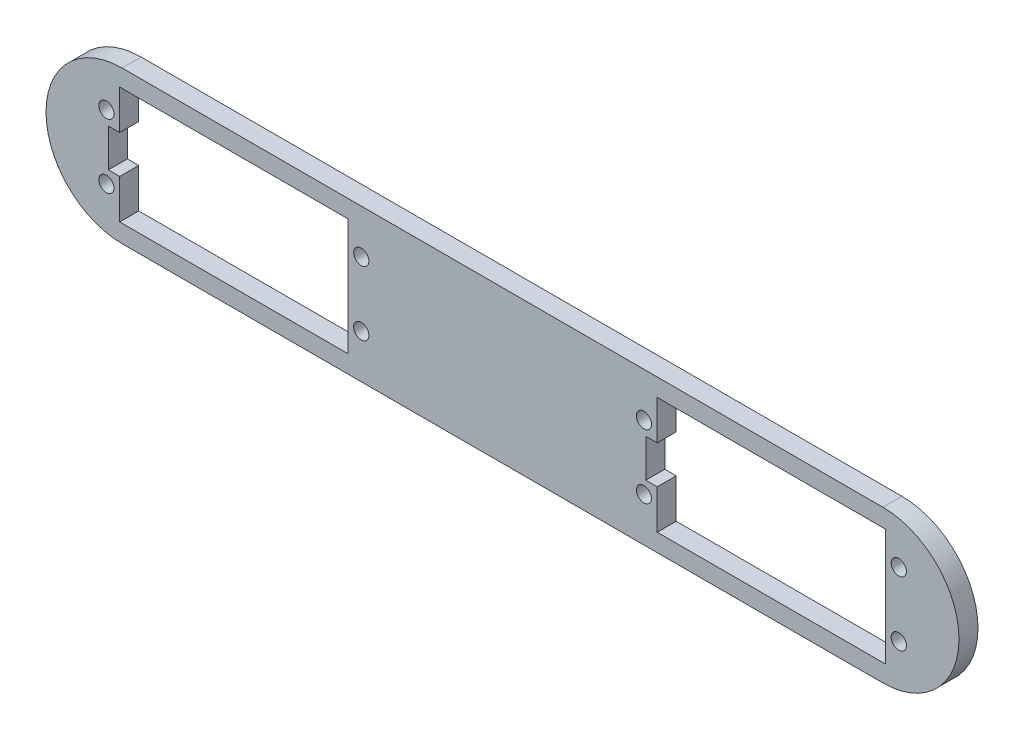
ISO-10303-21;
HEADER;
FILE_DESCRIPTION(('STEP AP214'),'2;1');
FILE_NAME('part.step','',(''),(''),'','','');
FILE_SCHEMA(('AUTOMOTIVE_DESIGN { 1 0 10303 214 1 1 1 1 }'));
ENDSEC;
DATA;
#1=APPLICATION_CONTEXT('core data for automotive mechanical design processes');
#2=APPLICATION_PROTOCOL_DEFINITION('international standard','automotive_design',2000,#1);
#3=PRODUCT_CONTEXT('',#1,'mechanical');
#4=PRODUCT('Part','Part','',(#3));
#5=PRODUCT_RELATED_PRODUCT_CATEGORY('part','',(#4));
#6=PRODUCT_DEFINITION_FORMATION('','',#4);
#7=PRODUCT_DEFINITION_CONTEXT('part definition',#1,'design');
#8=PRODUCT_DEFINITION('design','',#6,#7);
#9=PRODUCT_DEFINITION_SHAPE('','',#8);
#10=(LENGTH_UNIT() NAMED_UNIT(*) SI_UNIT(.MILLI.,.METRE.));
#11=(NAMED_UNIT(*) PLANE_ANGLE_UNIT() SI_UNIT($,.RADIAN.));
#12=(NAMED_UNIT(*) SI_UNIT($,.STERADIAN.) SOLID_ANGLE_UNIT());
#13=UNCERTAINTY_MEASURE_WITH_UNIT(LENGTH_MEASURE(1.E-05),#10,'distance_accuracy_value','');
#14=(GEOMETRIC_REPRESENTATION_CONTEXT(3) GLOBAL_UNCERTAINTY_ASSIGNED_CONTEXT((#13)) GLOBAL_UNIT_ASSIGNED_CONTEXT((#10,
#11,#12)) REPRESENTATION_CONTEXT('',''));
#15=CARTESIAN_POINT('',(0.,0.,0.));
#16=DIRECTION('',(0.,0.,1.));
#17=DIRECTION('',(1.,0.,0.));
#18=AXIS2_PLACEMENT_3D('',#15,#16,#17);
#19=CARTESIAN_POINT('',(0.,0.,5.));
#20=DIRECTION('',(0.,0.,1.));
#21=DIRECTION('',(1.,0.,0.));
#22=AXIS2_PLACEMENT_3D('',#19,#20,#21);
#23=PLANE('',#22);
#24=CARTESIAN_POINT('',(62.8784347206922,8.45000000000092,5.));
#25=DIRECTION('',(0.,0.,1.));
#26=DIRECTION('',(1.,0.,0.));
#27=AXIS2_PLACEMENT_3D('',#24,#25,#26);
#28=CIRCLE('',#27,2.);
#29=CARTESIAN_POINT('',(64.8784347206922,8.45000000000092,5.));
#30=VERTEX_POINT('',#29);
#31=EDGE_CURVE('E618',#30,#30,#28,.T.);
#32=ORIENTED_EDGE('',*,*,#31,.F.);
#33=EDGE_LOOP('',(#32));
#34=FACE_BOUND('',#33,.T.);
#35=CARTESIAN_POINT('',(62.8784347206922,-8.44999999999908,5.));
#36=DIRECTION('',(0.,0.,1.));
#37=DIRECTION('',(1.,0.,0.));
#38=AXIS2_PLACEMENT_3D('',#35,#36,#37);
#39=CIRCLE('',#38,2.);
#40=CARTESIAN_POINT('',(64.8784347206922,-8.44999999999908,5.));
#41=VERTEX_POINT('',#40);
#42=EDGE_CURVE('E628',#41,#41,#39,.T.);
#43=ORIENTED_EDGE('',*,*,#42,.F.);
#44=EDGE_LOOP('',(#43));
#45=FACE_BOUND('',#44,.T.);
#46=CARTESIAN_POINT('',(-4.12156527930781,-8.44999999999911,5.));
#47=DIRECTION('',(0.,0.,1.));
#48=DIRECTION('',(1.,0.,0.));
#49=AXIS2_PLACEMENT_3D('',#46,#47,#48);
#50=CIRCLE('',#49,2.00000000000001);
#51=CARTESIAN_POINT('',(-2.1215652793078,-8.44999999999911,5.));
#52=VERTEX_POINT('',#51);
#53=EDGE_CURVE('E634',#52,#52,#50,.T.);
#54=ORIENTED_EDGE('',*,*,#53,.F.);
#55=EDGE_LOOP('',(#54));
#56=FACE_BOUND('',#55,.T.);
#57=CARTESIAN_POINT('',(-4.12156527930781,8.45000000000091,5.));
#58=DIRECTION('',(0.,0.,1.));
#59=DIRECTION('',(1.,0.,0.));
#60=AXIS2_PLACEMENT_3D('',#57,#58,#59);
#61=CIRCLE('',#60,2.00000000000001);
#62=CARTESIAN_POINT('',(-2.1215652793078,8.45000000000091,5.));
#63=VERTEX_POINT('',#62);
#64=EDGE_CURVE('E640',#63,#63,#61,.T.);
#65=ORIENTED_EDGE('',*,*,#64,.F.);
#66=EDGE_LOOP('',(#65));
#67=FACE_BOUND('',#66,.T.);
#68=CARTESIAN_POINT('',(204.172709247136,-8.45000000000016,5.));
#69=DIRECTION('',(0.,0.,1.));
#70=DIRECTION('',(1.,0.,0.));
#71=AXIS2_PLACEMENT_3D('',#68,#69,#70);
#72=CIRCLE('',#71,2.);
#73=CARTESIAN_POINT('',(206.172709247136,-8.45000000000016,5.));
#74=VERTEX_POINT('',#73);
#75=EDGE_CURVE('E646',#74,#74,#72,.T.);
#76=ORIENTED_EDGE('',*,*,#75,.F.);
#77=EDGE_LOOP('',(#76));
#78=FACE_BOUND('',#77,.T.);
#79=CARTESIAN_POINT('',(204.172709247136,8.44999999999985,5.));
#80=DIRECTION('',(0.,0.,1.));
#81=DIRECTION('',(1.,0.,0.));
#82=AXIS2_PLACEMENT_3D('',#79,#80,#81);
#83=CIRCLE('',#82,1.99999999999999);
#84=CARTESIAN_POINT('',(206.172709247136,8.44999999999985,5.));
#85=VERTEX_POINT('',#84);
#86=EDGE_CURVE('E652',#85,#85,#83,.T.);
#87=ORIENTED_EDGE('',*,*,#86,.F.);
#88=EDGE_LOOP('',(#87));
#89=FACE_BOUND('',#88,.T.);
#90=CARTESIAN_POINT('',(137.172709247136,-8.45000000000024,5.));
#91=DIRECTION('',(0.,0.,1.));
#92=DIRECTION('',(1.,0.,0.));
#93=AXIS2_PLACEMENT_3D('',#90,#91,#92);
#94=CIRCLE('',#93,1.97954260621658);
#95=CARTESIAN_POINT('',(139.152251853353,-8.45000000000024,5.));
#96=VERTEX_POINT('',#95);
#97=EDGE_CURVE('E658',#96,#96,#94,.T.);
#98=ORIENTED_EDGE('',*,*,#97,.F.);
#99=EDGE_LOOP('',(#98));
#100=FACE_BOUND('',#99,.T.);
#101=CARTESIAN_POINT('',(137.172709247136,8.44999999999977,5.));
#102=DIRECTION('',(0.,0.,1.));
#103=DIRECTION('',(1.,0.,0.));
#104=AXIS2_PLACEMENT_3D('',#101,#102,#103);
#105=CIRCLE('',#104,2.);
#106=CARTESIAN_POINT('',(139.172709247136,8.44999999999977,5.));
#107=VERTEX_POINT('',#106);
#108=EDGE_CURVE('E206',#107,#107,#105,.T.);
#109=ORIENTED_EDGE('',*,*,#108,.F.);
#110=EDGE_LOOP('',(#109));
#111=FACE_BOUND('',#110,.T.);
#112=CARTESIAN_POINT('',(0.,0.,5.));
#113=DIRECTION('',(0.,0.,1.));
#114=DIRECTION('',(1.,0.,0.));
#115=AXIS2_PLACEMENT_3D('',#112,#113,#114);
#116=CIRCLE('',#115,20.);
#117=CARTESIAN_POINT('',(0.,20.,5.));
#118=VERTEX_POINT('',#117);
#119=CARTESIAN_POINT('',(0.,-20.,5.));
#120=VERTEX_POINT('',#119);
#121=EDGE_CURVE('E295',#118,#120,#116,.T.);
#122=ORIENTED_EDGE('',*,*,#121,.T.);
#123=DIRECTION('',(1.,0.,0.));
#124=VECTOR('',#123,1.);
#125=CARTESIAN_POINT('',(0.,-20.,5.));
#126=LINE('',#125,#124);
#127=CARTESIAN_POINT('',(200.,-20.,5.));
#128=VERTEX_POINT('',#127);
#129=EDGE_CURVE('E298',#120,#128,#126,.T.);
#130=ORIENTED_EDGE('',*,*,#129,.T.);
#131=CARTESIAN_POINT('',(200.,0.,5.));
#132=DIRECTION('',(0.,0.,1.));
#133=DIRECTION('',(1.,0.,0.));
#134=AXIS2_PLACEMENT_3D('',#131,#132,#133);
#135=CIRCLE('',#134,20.);
#136=CARTESIAN_POINT('',(200.,20.,5.));
#137=VERTEX_POINT('',#136);
#138=EDGE_CURVE('E301',#128,#137,#135,.T.);
#139=ORIENTED_EDGE('',*,*,#138,.T.);
#140=DIRECTION('',(-1.,0.,0.));
#141=VECTOR('',#140,1.);
#142=CARTESIAN_POINT('',(0.,20.,5.));
#143=LINE('',#142,#141);
#144=EDGE_CURVE('E303',#137,#118,#143,.T.);
#145=ORIENTED_EDGE('',*,*,#144,.T.);
#146=EDGE_LOOP('',(#122,#130,#139,#145));
#147=FACE_BOUND('',#146,.T.);
#148=DIRECTION('',(-1.,0.,0.));
#149=VECTOR('',#148,1.);
#150=CARTESIAN_POINT('',(-0.621565279305992,15.35,5.));
#151=LINE('',#150,#149);
#152=CARTESIAN_POINT('',(59.378434720694,15.35,5.));
#153=VERTEX_POINT('',#152);
#154=CARTESIAN_POINT('',(-0.621565279305992,15.35,5.));
#155=VERTEX_POINT('',#154);
#156=EDGE_CURVE('E238',#153,#155,#151,.T.);
#157=ORIENTED_EDGE('',*,*,#156,.F.);
#158=DIRECTION('',(0.,1.,0.));
#159=VECTOR('',#158,1.);
#160=CARTESIAN_POINT('',(59.378434720694,15.35,5.));
#161=LINE('',#160,#159);
#162=CARTESIAN_POINT('',(59.378434720694,-15.35,5.));
#163=VERTEX_POINT('',#162);
#164=EDGE_CURVE('E236',#163,#153,#161,.T.);
#165=ORIENTED_EDGE('',*,*,#164,.F.);
#166=DIRECTION('',(1.,0.,0.));
#167=VECTOR('',#166,1.);
#168=CARTESIAN_POINT('',(-0.621565279305986,-15.35,5.));
#169=LINE('',#168,#167);
#170=CARTESIAN_POINT('',(-0.621565279305986,-15.35,5.));
#171=VERTEX_POINT('',#170);
#172=EDGE_CURVE('E252',#171,#163,#169,.T.);
#173=ORIENTED_EDGE('',*,*,#172,.F.);
#174=DIRECTION('',(0.,-1.,0.));
#175=VECTOR('',#174,1.);
#176=CARTESIAN_POINT('',(-0.621565279305989,-5.,5.));
#177=LINE('',#176,#175);
#178=CARTESIAN_POINT('',(-0.621565279305989,-5.,5.));
#179=VERTEX_POINT('',#178);
#180=EDGE_CURVE('E249',#179,#171,#177,.T.);
#181=ORIENTED_EDGE('',*,*,#180,.F.);
#182=DIRECTION('',(1.,0.,0.));
#183=VECTOR('',#182,1.);
#184=CARTESIAN_POINT('',(-0.621565279305989,-5.,5.));
#185=LINE('',#184,#183);
#186=CARTESIAN_POINT('',(-3.62156527930599,-5.,5.));
#187=VERTEX_POINT('',#186);
#188=EDGE_CURVE('E247',#187,#179,#185,.T.);
#189=ORIENTED_EDGE('',*,*,#188,.F.);
#190=DIRECTION('',(0.,-1.,0.));
#191=VECTOR('',#190,1.);
#192=CARTESIAN_POINT('',(-3.62156527930599,5.,5.));
#193=LINE('',#192,#191);
#194=CARTESIAN_POINT('',(-3.62156527930599,5.,5.));
#195=VERTEX_POINT('',#194);
#196=EDGE_CURVE('E245',#195,#187,#193,.T.);
#197=ORIENTED_EDGE('',*,*,#196,.F.);
#198=DIRECTION('',(-1.,0.,0.));
#199=VECTOR('',#198,1.);
#200=CARTESIAN_POINT('',(-0.621565279305989,5.,5.));
#201=LINE('',#200,#199);
#202=CARTESIAN_POINT('',(-0.621565279305989,5.,5.));
#203=VERTEX_POINT('',#202);
#204=EDGE_CURVE('E243',#203,#195,#201,.T.);
#205=ORIENTED_EDGE('',*,*,#204,.F.);
#206=DIRECTION('',(0.,-1.,0.));
#207=VECTOR('',#206,1.);
#208=CARTESIAN_POINT('',(-0.621565279305992,15.35,5.));
#209=LINE('',#208,#207);
#210=EDGE_CURVE('E241',#155,#203,#209,.T.);
#211=ORIENTED_EDGE('',*,*,#210,.F.);
#212=EDGE_LOOP('',(#157,#165,#173,#181,#189,#197,#205,#211));
#213=FACE_BOUND('',#212,.T.);
#214=DIRECTION('',(-1.,0.,0.));
#215=VECTOR('',#214,1.);
#216=CARTESIAN_POINT('',(140.672709247137,15.35,5.));
#217=LINE('',#216,#215);
#218=CARTESIAN_POINT('',(200.672709247137,15.35,5.));
#219=VERTEX_POINT('',#218);
#220=CARTESIAN_POINT('',(140.672709247137,15.35,5.));
#221=VERTEX_POINT('',#220);
#222=EDGE_CURVE('E177',#219,#221,#217,.T.);
#223=ORIENTED_EDGE('',*,*,#222,.F.);
#224=DIRECTION('',(0.,1.,0.));
#225=VECTOR('',#224,1.);
#226=CARTESIAN_POINT('',(200.672709247137,15.35,5.));
#227=LINE('',#226,#225);
#228=CARTESIAN_POINT('',(200.672709247137,-15.35,5.));
#229=VERTEX_POINT('',#228);
#230=EDGE_CURVE('E169',#229,#219,#227,.T.);
#231=ORIENTED_EDGE('',*,*,#230,.F.);
#232=DIRECTION('',(1.,0.,0.));
#233=VECTOR('',#232,1.);
#234=CARTESIAN_POINT('',(140.672709247137,-15.35,5.));
#235=LINE('',#234,#233);
#236=CARTESIAN_POINT('',(140.672709247137,-15.35,5.));
#237=VERTEX_POINT('',#236);
#238=EDGE_CURVE('E203',#237,#229,#235,.T.);
#239=ORIENTED_EDGE('',*,*,#238,.F.);
#240=DIRECTION('',(0.,-1.,0.));
#241=VECTOR('',#240,1.);
#242=CARTESIAN_POINT('',(140.672709247137,-5.,5.));
#243=LINE('',#242,#241);
#244=CARTESIAN_POINT('',(140.672709247137,-5.,5.));
#245=VERTEX_POINT('',#244);
#246=EDGE_CURVE('E201',#245,#237,#243,.T.);
#247=ORIENTED_EDGE('',*,*,#246,.F.);
#248=DIRECTION('',(1.,0.,0.));
#249=VECTOR('',#248,1.);
#250=CARTESIAN_POINT('',(140.672709247137,-5.,5.));
#251=LINE('',#250,#249);
#252=CARTESIAN_POINT('',(137.672709247137,-5.,5.));
#253=VERTEX_POINT('',#252);
#254=EDGE_CURVE('E199',#253,#245,#251,.T.);
#255=ORIENTED_EDGE('',*,*,#254,.F.);
#256=DIRECTION('',(0.,-1.,0.));
#257=VECTOR('',#256,1.);
#258=CARTESIAN_POINT('',(137.672709247137,5.,5.));
#259=LINE('',#258,#257);
#260=CARTESIAN_POINT('',(137.672709247137,5.,5.));
#261=VERTEX_POINT('',#260);
#262=EDGE_CURVE('E197',#261,#253,#259,.T.);
#263=ORIENTED_EDGE('',*,*,#262,.F.);
#264=DIRECTION('',(-1.,0.,0.));
#265=VECTOR('',#264,1.);
#266=CARTESIAN_POINT('',(140.672709247137,5.,5.));
#267=LINE('',#266,#265);
#268=CARTESIAN_POINT('',(140.672709247137,5.,5.));
#269=VERTEX_POINT('',#268);
#270=EDGE_CURVE('E192',#269,#261,#267,.T.);
#271=ORIENTED_EDGE('',*,*,#270,.F.);
#272=DIRECTION('',(0.,-1.,0.));
#273=VECTOR('',#272,1.);
#274=CARTESIAN_POINT('',(140.672709247137,15.35,5.));
#275=LINE('',#274,#273);
#276=EDGE_CURVE('E190',#221,#269,#275,.T.);
#277=ORIENTED_EDGE('',*,*,#276,.F.);
#278=EDGE_LOOP('',(#223,#231,#239,#247,#255,#263,#271,#277));
#279=FACE_BOUND('',#278,.T.);
#280=ADVANCED_FACE('F32',(#34,#45,#56,#67,#78,#89,#100,#111,#147,#213,#279),#23,.T.);
#281=CARTESIAN_POINT('',(0.,0.,0.));
#282=DIRECTION('',(0.,0.,1.));
#283=DIRECTION('',(1.,0.,0.));
#284=AXIS2_PLACEMENT_3D('',#281,#282,#283);
#285=PLANE('',#284);
#286=CARTESIAN_POINT('',(62.8784347206922,8.45000000000092,0.));
#287=DIRECTION('',(0.,0.,-1.));
#288=DIRECTION('',(-1.,0.,0.));
#289=AXIS2_PLACEMENT_3D('',#286,#287,#288);
#290=CIRCLE('',#289,2.);
#291=CARTESIAN_POINT('',(60.8784347206922,8.45000000000092,0.));
#292=VERTEX_POINT('',#291);
#293=EDGE_CURVE('E621',#292,#292,#290,.T.);
#294=ORIENTED_EDGE('',*,*,#293,.F.);
#295=EDGE_LOOP('',(#294));
#296=FACE_BOUND('',#295,.T.);
#297=CARTESIAN_POINT('',(62.8784347206922,-8.44999999999908,0.));
#298=DIRECTION('',(0.,0.,-1.));
#299=DIRECTION('',(-1.,0.,0.));
#300=AXIS2_PLACEMENT_3D('',#297,#298,#299);
#301=CIRCLE('',#300,2.);
#302=CARTESIAN_POINT('',(60.8784347206922,-8.44999999999908,0.));
#303=VERTEX_POINT('',#302);
#304=EDGE_CURVE('E623',#303,#303,#301,.T.);
#305=ORIENTED_EDGE('',*,*,#304,.F.);
#306=EDGE_LOOP('',(#305));
#307=FACE_BOUND('',#306,.T.);
#308=CARTESIAN_POINT('',(-4.12156527930781,-8.44999999999911,0.));
#309=DIRECTION('',(0.,0.,-1.));
#310=DIRECTION('',(-1.,0.,0.));
#311=AXIS2_PLACEMENT_3D('',#308,#309,#310);
#312=CIRCLE('',#311,2.00000000000001);
#313=CARTESIAN_POINT('',(-6.12156527930782,-8.44999999999911,0.));
#314=VERTEX_POINT('',#313);
#315=EDGE_CURVE('E631',#314,#314,#312,.T.);
#316=ORIENTED_EDGE('',*,*,#315,.F.);
#317=EDGE_LOOP('',(#316));
#318=FACE_BOUND('',#317,.T.);
#319=CARTESIAN_POINT('',(-4.12156527930781,8.45000000000091,0.));
#320=DIRECTION('',(0.,0.,-1.));
#321=DIRECTION('',(-1.,0.,0.));
#322=AXIS2_PLACEMENT_3D('',#319,#320,#321);
#323=CIRCLE('',#322,2.00000000000001);
#324=CARTESIAN_POINT('',(-6.12156527930782,8.45000000000091,0.));
#325=VERTEX_POINT('',#324);
#326=EDGE_CURVE('E637',#325,#325,#323,.T.);
#327=ORIENTED_EDGE('',*,*,#326,.F.);
#328=EDGE_LOOP('',(#327));
#329=FACE_BOUND('',#328,.T.);
#330=CARTESIAN_POINT('',(204.172709247136,-8.45000000000016,0.));
#331=DIRECTION('',(0.,0.,-1.));
#332=DIRECTION('',(-1.,0.,0.));
#333=AXIS2_PLACEMENT_3D('',#330,#331,#332);
#334=CIRCLE('',#333,2.);
#335=CARTESIAN_POINT('',(202.172709247136,-8.45000000000016,0.));
#336=VERTEX_POINT('',#335);
#337=EDGE_CURVE('E643',#336,#336,#334,.T.);
#338=ORIENTED_EDGE('',*,*,#337,.F.);
#339=EDGE_LOOP('',(#338));
#340=FACE_BOUND('',#339,.T.);
#341=CARTESIAN_POINT('',(204.172709247136,8.44999999999985,0.));
#342=DIRECTION('',(0.,0.,-1.));
#343=DIRECTION('',(-1.,0.,0.));
#344=AXIS2_PLACEMENT_3D('',#341,#342,#343);
#345=CIRCLE('',#344,1.99999999999999);
#346=CARTESIAN_POINT('',(202.172709247136,8.44999999999985,0.));
#347=VERTEX_POINT('',#346);
#348=EDGE_CURVE('E649',#347,#347,#345,.T.);
#349=ORIENTED_EDGE('',*,*,#348,.F.);
#350=EDGE_LOOP('',(#349));
#351=FACE_BOUND('',#350,.T.);
#352=CARTESIAN_POINT('',(137.172709247136,-8.45000000000024,0.));
#353=DIRECTION('',(0.,0.,-1.));
#354=DIRECTION('',(-1.,0.,0.));
#355=AXIS2_PLACEMENT_3D('',#352,#353,#354);
#356=CIRCLE('',#355,1.97954260621658);
#357=CARTESIAN_POINT('',(135.19316664092,-8.45000000000024,0.));
#358=VERTEX_POINT('',#357);
#359=EDGE_CURVE('E655',#358,#358,#356,.T.);
#360=ORIENTED_EDGE('',*,*,#359,.F.);
#361=EDGE_LOOP('',(#360));
#362=FACE_BOUND('',#361,.T.);
#363=CARTESIAN_POINT('',(137.172709247136,8.44999999999977,0.));
#364=DIRECTION('',(0.,0.,-1.));
#365=DIRECTION('',(-1.,0.,0.));
#366=AXIS2_PLACEMENT_3D('',#363,#364,#365);
#367=CIRCLE('',#366,2.);
#368=CARTESIAN_POINT('',(135.172709247136,8.44999999999977,0.));
#369=VERTEX_POINT('',#368);
#370=EDGE_CURVE('E661',#369,#369,#367,.T.);
#371=ORIENTED_EDGE('',*,*,#370,.F.);
#372=EDGE_LOOP('',(#371));
#373=FACE_BOUND('',#372,.T.);
#374=DIRECTION('',(0.,1.,0.));
#375=VECTOR('',#374,1.);
#376=CARTESIAN_POINT('',(59.378434720694,15.35,0.));
#377=LINE('',#376,#375);
#378=CARTESIAN_POINT('',(59.378434720694,-15.35,0.));
#379=VERTEX_POINT('',#378);
#380=CARTESIAN_POINT('',(59.378434720694,15.35,0.));
#381=VERTEX_POINT('',#380);
#382=EDGE_CURVE('E185',#379,#381,#377,.T.);
#383=ORIENTED_EDGE('',*,*,#382,.T.);
#384=DIRECTION('',(-1.,0.,0.));
#385=VECTOR('',#384,1.);
#386=CARTESIAN_POINT('',(-0.621565279305992,15.35,0.));
#387=LINE('',#386,#385);
#388=CARTESIAN_POINT('',(-0.621565279305992,15.35,0.));
#389=VERTEX_POINT('',#388);
#390=EDGE_CURVE('E257',#381,#389,#387,.T.);
#391=ORIENTED_EDGE('',*,*,#390,.T.);
#392=DIRECTION('',(0.,-1.,0.));
#393=VECTOR('',#392,1.);
#394=CARTESIAN_POINT('',(-0.621565279305992,15.35,0.));
#395=LINE('',#394,#393);
#396=CARTESIAN_POINT('',(-0.621565279305989,5.,0.));
#397=VERTEX_POINT('',#396);
#398=EDGE_CURVE('E260',#389,#397,#395,.T.);
#399=ORIENTED_EDGE('',*,*,#398,.T.);
#400=DIRECTION('',(-1.,0.,0.));
#401=VECTOR('',#400,1.);
#402=CARTESIAN_POINT('',(-0.621565279305989,5.,0.));
#403=LINE('',#402,#401);
#404=CARTESIAN_POINT('',(-3.62156527930599,5.,0.));
#405=VERTEX_POINT('',#404);
#406=EDGE_CURVE('E263',#397,#405,#403,.T.);
#407=ORIENTED_EDGE('',*,*,#406,.T.);
#408=DIRECTION('',(0.,-1.,0.));
#409=VECTOR('',#408,1.);
#410=CARTESIAN_POINT('',(-3.62156527930599,5.,0.));
#411=LINE('',#410,#409);
#412=CARTESIAN_POINT('',(-3.62156527930599,-5.,0.));
#413=VERTEX_POINT('',#412);
#414=EDGE_CURVE('E266',#405,#413,#411,.T.);
#415=ORIENTED_EDGE('',*,*,#414,.T.);
#416=DIRECTION('',(1.,0.,0.));
#417=VECTOR('',#416,1.);
#418=CARTESIAN_POINT('',(-0.621565279305989,-5.,0.));
#419=LINE('',#418,#417);
#420=CARTESIAN_POINT('',(-0.621565279305989,-5.,0.));
#421=VERTEX_POINT('',#420);
#422=EDGE_CURVE('E269',#413,#421,#419,.T.);
#423=ORIENTED_EDGE('',*,*,#422,.T.);
#424=DIRECTION('',(0.,-1.,0.));
#425=VECTOR('',#424,1.);
#426=CARTESIAN_POINT('',(-0.621565279305989,-5.,0.));
#427=LINE('',#426,#425);
#428=CARTESIAN_POINT('',(-0.621565279305986,-15.35,0.));
#429=VERTEX_POINT('',#428);
#430=EDGE_CURVE('E272',#421,#429,#427,.T.);
#431=ORIENTED_EDGE('',*,*,#430,.T.);
#432=DIRECTION('',(1.,0.,0.));
#433=VECTOR('',#432,1.);
#434=CARTESIAN_POINT('',(-0.621565279305986,-15.35,0.));
#435=LINE('',#434,#433);
#436=EDGE_CURVE('E239',#429,#379,#435,.T.);
#437=ORIENTED_EDGE('',*,*,#436,.T.);
#438=EDGE_LOOP('',(#383,#391,#399,#407,#415,#423,#431,#437));
#439=FACE_BOUND('',#438,.T.);
#440=CARTESIAN_POINT('',(0.,0.,0.));
#441=DIRECTION('',(0.,0.,1.));
#442=DIRECTION('',(1.,0.,0.));
#443=AXIS2_PLACEMENT_3D('',#440,#441,#442);
#444=CIRCLE('',#443,20.);
#445=CARTESIAN_POINT('',(0.,20.,0.));
#446=VERTEX_POINT('',#445);
#447=CARTESIAN_POINT('',(0.,-20.,0.));
#448=VERTEX_POINT('',#447);
#449=EDGE_CURVE('E294',#446,#448,#444,.T.);
#450=ORIENTED_EDGE('',*,*,#449,.F.);
#451=DIRECTION('',(-1.,0.,0.));
#452=VECTOR('',#451,1.);
#453=CARTESIAN_POINT('',(0.,20.,0.));
#454=LINE('',#453,#452);
#455=CARTESIAN_POINT('',(200.,20.,0.));
#456=VERTEX_POINT('',#455);
#457=EDGE_CURVE('E299',#456,#446,#454,.T.);
#458=ORIENTED_EDGE('',*,*,#457,.F.);
#459=CARTESIAN_POINT('',(200.,0.,0.));
#460=DIRECTION('',(0.,0.,1.));
#461=DIRECTION('',(1.,0.,0.));
#462=AXIS2_PLACEMENT_3D('',#459,#460,#461);
#463=CIRCLE('',#462,20.);
#464=CARTESIAN_POINT('',(200.,-20.,0.));
#465=VERTEX_POINT('',#464);
#466=EDGE_CURVE('E310',#465,#456,#463,.T.);
#467=ORIENTED_EDGE('',*,*,#466,.F.);
#468=DIRECTION('',(1.,0.,0.));
#469=VECTOR('',#468,1.);
#470=CARTESIAN_POINT('',(0.,-20.,0.));
#471=LINE('',#470,#469);
#472=EDGE_CURVE('E308',#448,#465,#471,.T.);
#473=ORIENTED_EDGE('',*,*,#472,.F.);
#474=EDGE_LOOP('',(#450,#458,#467,#473));
#475=FACE_BOUND('',#474,.T.);
#476=DIRECTION('',(0.,1.,0.));
#477=VECTOR('',#476,1.);
#478=CARTESIAN_POINT('',(200.672709247137,15.35,0.));
#479=LINE('',#478,#477);
#480=CARTESIAN_POINT('',(200.672709247137,-15.35,0.));
#481=VERTEX_POINT('',#480);
#482=CARTESIAN_POINT('',(200.672709247137,15.35,0.));
#483=VERTEX_POINT('',#482);
#484=EDGE_CURVE('E55',#481,#483,#479,.T.);
#485=ORIENTED_EDGE('',*,*,#484,.T.);
#486=DIRECTION('',(-1.,0.,0.));
#487=VECTOR('',#486,1.);
#488=CARTESIAN_POINT('',(140.672709247137,15.35,0.));
#489=LINE('',#488,#487);
#490=CARTESIAN_POINT('',(140.672709247137,15.35,0.));
#491=VERTEX_POINT('',#490);
#492=EDGE_CURVE('E184',#483,#491,#489,.T.);
#493=ORIENTED_EDGE('',*,*,#492,.T.);
#494=DIRECTION('',(0.,-1.,0.));
#495=VECTOR('',#494,1.);
#496=CARTESIAN_POINT('',(140.672709247137,15.35,0.));
#497=LINE('',#496,#495);
#498=CARTESIAN_POINT('',(140.672709247137,5.,0.));
#499=VERTEX_POINT('',#498);
#500=EDGE_CURVE('E208',#491,#499,#497,.T.);
#501=ORIENTED_EDGE('',*,*,#500,.T.);
#502=DIRECTION('',(-1.,0.,0.));
#503=VECTOR('',#502,1.);
#504=CARTESIAN_POINT('',(140.672709247137,5.,0.));
#505=LINE('',#504,#503);
#506=CARTESIAN_POINT('',(137.672709247137,5.,0.));
#507=VERTEX_POINT('',#506);
#508=EDGE_CURVE('E211',#499,#507,#505,.T.);
#509=ORIENTED_EDGE('',*,*,#508,.T.);
#510=DIRECTION('',(0.,-1.,0.));
#511=VECTOR('',#510,1.);
#512=CARTESIAN_POINT('',(137.672709247137,5.,0.));
#513=LINE('',#512,#511);
#514=CARTESIAN_POINT('',(137.672709247137,-5.,0.));
#515=VERTEX_POINT('',#514);
#516=EDGE_CURVE('E214',#507,#515,#513,.T.);
#517=ORIENTED_EDGE('',*,*,#516,.T.);
#518=DIRECTION('',(1.,0.,0.));
#519=VECTOR('',#518,1.);
#520=CARTESIAN_POINT('',(140.672709247137,-5.,0.));
#521=LINE('',#520,#519);
#522=CARTESIAN_POINT('',(140.672709247137,-5.,0.));
#523=VERTEX_POINT('',#522);
#524=EDGE_CURVE('E217',#515,#523,#521,.T.);
#525=ORIENTED_EDGE('',*,*,#524,.T.);
#526=DIRECTION('',(0.,-1.,0.));
#527=VECTOR('',#526,1.);
#528=CARTESIAN_POINT('',(140.672709247137,-5.,0.));
#529=LINE('',#528,#527);
#530=CARTESIAN_POINT('',(140.672709247137,-15.35,0.));
#531=VERTEX_POINT('',#530);
#532=EDGE_CURVE('E220',#523,#531,#529,.T.);
#533=ORIENTED_EDGE('',*,*,#532,.T.);
#534=DIRECTION('',(1.,0.,0.));
#535=VECTOR('',#534,1.);
#536=CARTESIAN_POINT('',(140.672709247137,-15.35,0.));
#537=LINE('',#536,#535);
#538=EDGE_CURVE('E178',#531,#481,#537,.T.);
#539=ORIENTED_EDGE('',*,*,#538,.T.);
#540=EDGE_LOOP('',(#485,#493,#501,#509,#517,#525,#533,#539));
#541=FACE_BOUND('',#540,.T.);
#542=ADVANCED_FACE('F328',(#296,#307,#318,#329,#340,#351,#362,#373,#439,#475,#541),#285,.F.);
#543=CARTESIAN_POINT('',(0.,0.,5.));
#544=DIRECTION('',(0.,0.,-1.));
#545=DIRECTION('',(-1.,0.,0.));
#546=AXIS2_PLACEMENT_3D('',#543,#544,#545);
#547=CYLINDRICAL_SURFACE('',#546,20.);
#548=ORIENTED_EDGE('',*,*,#449,.T.);
#549=DIRECTION('',(0.,0.,-1.));
#550=VECTOR('',#549,1.);
#551=CARTESIAN_POINT('',(0.,-20.,5.));
#552=LINE('',#551,#550);
#553=EDGE_CURVE('E11',#120,#448,#552,.T.);
#554=ORIENTED_EDGE('',*,*,#553,.F.);
#555=ORIENTED_EDGE('',*,*,#121,.F.);
#556=DIRECTION('',(0.,0.,-1.));
#557=VECTOR('',#556,1.);
#558=CARTESIAN_POINT('',(0.,20.,5.));
#559=LINE('',#558,#557);
#560=EDGE_CURVE('E305',#118,#446,#559,.T.);
#561=ORIENTED_EDGE('',*,*,#560,.T.);
#562=EDGE_LOOP('',(#548,#554,#555,#561));
#563=FACE_BOUND('',#562,.T.);
#564=ADVANCED_FACE('F34',(#563),#547,.T.);
#565=CARTESIAN_POINT('',(0.,-20.,5.));
#566=DIRECTION('',(0.,1.,0.));
#567=DIRECTION('',(0.,0.,1.));
#568=AXIS2_PLACEMENT_3D('',#565,#566,#567);
#569=PLANE('',#568);
#570=ORIENTED_EDGE('',*,*,#472,.T.);
#571=DIRECTION('',(0.,0.,-1.));
#572=VECTOR('',#571,1.);
#573=CARTESIAN_POINT('',(200.,-20.,5.));
#574=LINE('',#573,#572);
#575=EDGE_CURVE('E40',#128,#465,#574,.T.);
#576=ORIENTED_EDGE('',*,*,#575,.F.);
#577=ORIENTED_EDGE('',*,*,#129,.F.);
#578=ORIENTED_EDGE('',*,*,#553,.T.);
#579=EDGE_LOOP('',(#570,#576,#577,#578));
#580=FACE_BOUND('',#579,.T.);
#581=ADVANCED_FACE('F339',(#580),#569,.F.);
#582=CARTESIAN_POINT('',(200.,0.,5.));
#583=DIRECTION('',(0.,0.,-1.));
#584=DIRECTION('',(-1.,0.,0.));
#585=AXIS2_PLACEMENT_3D('',#582,#583,#584);
#586=CYLINDRICAL_SURFACE('',#585,20.);
#587=ORIENTED_EDGE('',*,*,#466,.T.);
#588=DIRECTION('',(0.,0.,-1.));
#589=VECTOR('',#588,1.);
#590=CARTESIAN_POINT('',(200.,20.,5.));
#591=LINE('',#590,#589);
#592=EDGE_CURVE('E315',#137,#456,#591,.T.);
#593=ORIENTED_EDGE('',*,*,#592,.F.);
#594=ORIENTED_EDGE('',*,*,#138,.F.);
#595=ORIENTED_EDGE('',*,*,#575,.T.);
#596=EDGE_LOOP('',(#587,#593,#594,#595));
#597=FACE_BOUND('',#596,.T.);
#598=ADVANCED_FACE('F322',(#597),#586,.T.);
#599=CARTESIAN_POINT('',(0.,20.,5.));
#600=DIRECTION('',(0.,-1.,0.));
#601=DIRECTION('',(0.,0.,-1.));
#602=AXIS2_PLACEMENT_3D('',#599,#600,#601);
#603=PLANE('',#602);
#604=ORIENTED_EDGE('',*,*,#457,.T.);
#605=ORIENTED_EDGE('',*,*,#560,.F.);
#606=ORIENTED_EDGE('',*,*,#144,.F.);
#607=ORIENTED_EDGE('',*,*,#592,.T.);
#608=EDGE_LOOP('',(#604,#605,#606,#607));
#609=FACE_BOUND('',#608,.T.);
#610=ADVANCED_FACE('F332',(#609),#603,.F.);
#611=CARTESIAN_POINT('',(59.378434720694,15.35,5.));
#612=DIRECTION('',(-1.,0.,0.));
#613=DIRECTION('',(0.,-1.,0.));
#614=AXIS2_PLACEMENT_3D('',#611,#612,#613);
#615=PLANE('',#614);
#616=ORIENTED_EDGE('',*,*,#382,.F.);
#617=DIRECTION('',(0.,0.,-1.));
#618=VECTOR('',#617,1.);
#619=CARTESIAN_POINT('',(59.378434720694,-15.35,5.));
#620=LINE('',#619,#618);
#621=EDGE_CURVE('E254',#163,#379,#620,.T.);
#622=ORIENTED_EDGE('',*,*,#621,.F.);
#623=ORIENTED_EDGE('',*,*,#164,.T.);
#624=DIRECTION('',(0.,0.,-1.));
#625=VECTOR('',#624,1.);
#626=CARTESIAN_POINT('',(59.378434720694,15.35,5.));
#627=LINE('',#626,#625);
#628=EDGE_CURVE('E291',#153,#381,#627,.T.);
#629=ORIENTED_EDGE('',*,*,#628,.T.);
#630=EDGE_LOOP('',(#616,#622,#623,#629));
#631=FACE_BOUND('',#630,.T.);
#632=ADVANCED_FACE('F357',(#631),#615,.T.);
#633=CARTESIAN_POINT('',(-0.621565279305992,15.35,5.));
#634=DIRECTION('',(0.,-1.,0.));
#635=DIRECTION('',(0.,0.,-1.));
#636=AXIS2_PLACEMENT_3D('',#633,#634,#635);
#637=PLANE('',#636);
#638=ORIENTED_EDGE('',*,*,#390,.F.);
#639=ORIENTED_EDGE('',*,*,#628,.F.);
#640=ORIENTED_EDGE('',*,*,#156,.T.);
#641=DIRECTION('',(0.,0.,-1.));
#642=VECTOR('',#641,1.);
#643=CARTESIAN_POINT('',(-0.621565279305992,15.35,5.));
#644=LINE('',#643,#642);
#645=EDGE_CURVE('E289',#155,#389,#644,.T.);
#646=ORIENTED_EDGE('',*,*,#645,.T.);
#647=EDGE_LOOP('',(#638,#639,#640,#646));
#648=FACE_BOUND('',#647,.T.);
#649=ADVANCED_FACE('F364',(#648),#637,.T.);
#650=CARTESIAN_POINT('',(-0.621565279305992,15.35,5.));
#651=DIRECTION('',(1.,0.,0.));
#652=DIRECTION('',(0.,1.,0.));
#653=AXIS2_PLACEMENT_3D('',#650,#651,#652);
#654=PLANE('',#653);
#655=ORIENTED_EDGE('',*,*,#398,.F.);
#656=ORIENTED_EDGE('',*,*,#645,.F.);
#657=ORIENTED_EDGE('',*,*,#210,.T.);
#658=DIRECTION('',(0.,0.,-1.));
#659=VECTOR('',#658,1.);
#660=CARTESIAN_POINT('',(-0.621565279305989,5.,5.));
#661=LINE('',#660,#659);
#662=EDGE_CURVE('E287',#203,#397,#661,.T.);
#663=ORIENTED_EDGE('',*,*,#662,.T.);
#664=EDGE_LOOP('',(#655,#656,#657,#663));
#665=FACE_BOUND('',#664,.T.);
#666=ADVANCED_FACE('F369',(#665),#654,.T.);
#667=CARTESIAN_POINT('',(-0.621565279305989,5.,5.));
#668=DIRECTION('',(0.,-1.,0.));
#669=DIRECTION('',(1.,0.,0.));
#670=AXIS2_PLACEMENT_3D('',#667,#668,#669);
#671=PLANE('',#670);
#672=ORIENTED_EDGE('',*,*,#406,.F.);
#673=ORIENTED_EDGE('',*,*,#662,.F.);
#674=ORIENTED_EDGE('',*,*,#204,.T.);
#675=DIRECTION('',(0.,0.,-1.));
#676=VECTOR('',#675,1.);
#677=CARTESIAN_POINT('',(-3.62156527930599,5.,5.));
#678=LINE('',#677,#676);
#679=EDGE_CURVE('E285',#195,#405,#678,.T.);
#680=ORIENTED_EDGE('',*,*,#679,.T.);
#681=EDGE_LOOP('',(#672,#673,#674,#680));
#682=FACE_BOUND('',#681,.T.);
#683=ADVANCED_FACE('F395',(#682),#671,.T.);
#684=CARTESIAN_POINT('',(-3.62156527930599,5.,5.));
#685=DIRECTION('',(1.,0.,0.));
#686=DIRECTION('',(0.,0.,-1.));
#687=AXIS2_PLACEMENT_3D('',#684,#685,#686);
#688=PLANE('',#687);
#689=ORIENTED_EDGE('',*,*,#414,.F.);
#690=ORIENTED_EDGE('',*,*,#679,.F.);
#691=ORIENTED_EDGE('',*,*,#196,.T.);
#692=DIRECTION('',(0.,0.,-1.));
#693=VECTOR('',#692,1.);
#694=CARTESIAN_POINT('',(-3.62156527930599,-5.,5.));
#695=LINE('',#694,#693);
#696=EDGE_CURVE('E283',#187,#413,#695,.T.);
#697=ORIENTED_EDGE('',*,*,#696,.T.);
#698=EDGE_LOOP('',(#689,#690,#691,#697));
#699=FACE_BOUND('',#698,.T.);
#700=ADVANCED_FACE('F400',(#699),#688,.T.);
#701=CARTESIAN_POINT('',(-0.621565279305989,-5.,5.));
#702=DIRECTION('',(0.,1.,0.));
#703=DIRECTION('',(-1.,0.,0.));
#704=AXIS2_PLACEMENT_3D('',#701,#702,#703);
#705=PLANE('',#704);
#706=ORIENTED_EDGE('',*,*,#422,.F.);
#707=ORIENTED_EDGE('',*,*,#696,.F.);
#708=ORIENTED_EDGE('',*,*,#188,.T.);
#709=DIRECTION('',(0.,0.,-1.));
#710=VECTOR('',#709,1.);
#711=CARTESIAN_POINT('',(-0.621565279305989,-5.,5.));
#712=LINE('',#711,#710);
#713=EDGE_CURVE('E281',#179,#421,#712,.T.);
#714=ORIENTED_EDGE('',*,*,#713,.T.);
#715=EDGE_LOOP('',(#706,#707,#708,#714));
#716=FACE_BOUND('',#715,.T.);
#717=ADVANCED_FACE('F403',(#716),#705,.T.);
#718=CARTESIAN_POINT('',(-0.621565279305989,-5.,5.));
#719=DIRECTION('',(1.,0.,0.));
#720=DIRECTION('',(0.,1.,0.));
#721=AXIS2_PLACEMENT_3D('',#718,#719,#720);
#722=PLANE('',#721);
#723=ORIENTED_EDGE('',*,*,#430,.F.);
#724=ORIENTED_EDGE('',*,*,#713,.F.);
#725=ORIENTED_EDGE('',*,*,#180,.T.);
#726=DIRECTION('',(0.,0.,-1.));
#727=VECTOR('',#726,1.);
#728=CARTESIAN_POINT('',(-0.621565279305986,-15.35,5.));
#729=LINE('',#728,#727);
#730=EDGE_CURVE('E279',#171,#429,#729,.T.);
#731=ORIENTED_EDGE('',*,*,#730,.T.);
#732=EDGE_LOOP('',(#723,#724,#725,#731));
#733=FACE_BOUND('',#732,.T.);
#734=ADVANCED_FACE('F383',(#733),#722,.T.);
#735=CARTESIAN_POINT('',(-0.621565279305986,-15.35,5.));
#736=DIRECTION('',(0.,1.,0.));
#737=DIRECTION('',(0.,0.,1.));
#738=AXIS2_PLACEMENT_3D('',#735,#736,#737);
#739=PLANE('',#738);
#740=ORIENTED_EDGE('',*,*,#436,.F.);
#741=ORIENTED_EDGE('',*,*,#730,.F.);
#742=ORIENTED_EDGE('',*,*,#172,.T.);
#743=ORIENTED_EDGE('',*,*,#621,.T.);
#744=EDGE_LOOP('',(#740,#741,#742,#743));
#745=FACE_BOUND('',#744,.T.);
#746=ADVANCED_FACE('F377',(#745),#739,.T.);
#747=CARTESIAN_POINT('',(200.672709247137,15.35,5.));
#748=DIRECTION('',(-1.,0.,0.));
#749=DIRECTION('',(0.,-1.,0.));
#750=AXIS2_PLACEMENT_3D('',#747,#748,#749);
#751=PLANE('',#750);
#752=ORIENTED_EDGE('',*,*,#484,.F.);
#753=DIRECTION('',(0.,0.,-1.));
#754=VECTOR('',#753,1.);
#755=CARTESIAN_POINT('',(200.672709247137,-15.35,5.));
#756=LINE('',#755,#754);
#757=EDGE_CURVE('E173',#229,#481,#756,.T.);
#758=ORIENTED_EDGE('',*,*,#757,.F.);
#759=ORIENTED_EDGE('',*,*,#230,.T.);
#760=DIRECTION('',(0.,0.,-1.));
#761=VECTOR('',#760,1.);
#762=CARTESIAN_POINT('',(200.672709247137,15.35,5.));
#763=LINE('',#762,#761);
#764=EDGE_CURVE('E172',#219,#483,#763,.T.);
#765=ORIENTED_EDGE('',*,*,#764,.T.);
#766=EDGE_LOOP('',(#752,#758,#759,#765));
#767=FACE_BOUND('',#766,.T.);
#768=ADVANCED_FACE('F171',(#767),#751,.T.);
#769=CARTESIAN_POINT('',(140.672709247137,15.35,5.));
#770=DIRECTION('',(0.,-1.,0.));
#771=DIRECTION('',(0.,0.,-1.));
#772=AXIS2_PLACEMENT_3D('',#769,#770,#771);
#773=PLANE('',#772);
#774=ORIENTED_EDGE('',*,*,#492,.F.);
#775=ORIENTED_EDGE('',*,*,#764,.F.);
#776=ORIENTED_EDGE('',*,*,#222,.T.);
#777=DIRECTION('',(0.,0.,-1.));
#778=VECTOR('',#777,1.);
#779=CARTESIAN_POINT('',(140.672709247137,15.35,5.));
#780=LINE('',#779,#778);
#781=EDGE_CURVE('E186',#221,#491,#780,.T.);
#782=ORIENTED_EDGE('',*,*,#781,.T.);
#783=EDGE_LOOP('',(#774,#775,#776,#782));
#784=FACE_BOUND('',#783,.T.);
#785=ADVANCED_FACE('F181',(#784),#773,.T.);
#786=CARTESIAN_POINT('',(140.672709247137,15.35,5.));
#787=DIRECTION('',(1.,0.,0.));
#788=DIRECTION('',(0.,0.,-1.));
#789=AXIS2_PLACEMENT_3D('',#786,#787,#788);
#790=PLANE('',#789);
#791=ORIENTED_EDGE('',*,*,#500,.F.);
#792=ORIENTED_EDGE('',*,*,#781,.F.);
#793=ORIENTED_EDGE('',*,*,#276,.T.);
#794=DIRECTION('',(0.,0.,-1.));
#795=VECTOR('',#794,1.);
#796=CARTESIAN_POINT('',(140.672709247137,5.,5.));
#797=LINE('',#796,#795);
#798=EDGE_CURVE('E233',#269,#499,#797,.T.);
#799=ORIENTED_EDGE('',*,*,#798,.T.);
#800=EDGE_LOOP('',(#791,#792,#793,#799));
#801=FACE_BOUND('',#800,.T.);
#802=ADVANCED_FACE('F463',(#801),#790,.T.);
#803=CARTESIAN_POINT('',(140.672709247137,5.,5.));
#804=DIRECTION('',(0.,-1.,0.));
#805=DIRECTION('',(1.,0.,0.));
#806=AXIS2_PLACEMENT_3D('',#803,#804,#805);
#807=PLANE('',#806);
#808=ORIENTED_EDGE('',*,*,#508,.F.);
#809=ORIENTED_EDGE('',*,*,#798,.F.);
#810=ORIENTED_EDGE('',*,*,#270,.T.);
#811=DIRECTION('',(0.,0.,-1.));
#812=VECTOR('',#811,1.);
#813=CARTESIAN_POINT('',(137.672709247137,5.,5.));
#814=LINE('',#813,#812);
#815=EDGE_CURVE('E231',#261,#507,#814,.T.);
#816=ORIENTED_EDGE('',*,*,#815,.T.);
#817=EDGE_LOOP('',(#808,#809,#810,#816));
#818=FACE_BOUND('',#817,.T.);
#819=ADVANCED_FACE('F472',(#818),#807,.T.);
#820=CARTESIAN_POINT('',(137.672709247137,5.,5.));
#821=DIRECTION('',(1.,0.,0.));
#822=DIRECTION('',(0.,0.,-1.));
#823=AXIS2_PLACEMENT_3D('',#820,#821,#822);
#824=PLANE('',#823);
#825=ORIENTED_EDGE('',*,*,#516,.F.);
#826=ORIENTED_EDGE('',*,*,#815,.F.);
#827=ORIENTED_EDGE('',*,*,#262,.T.);
#828=DIRECTION('',(0.,0.,-1.));
#829=VECTOR('',#828,1.);
#830=CARTESIAN_POINT('',(137.672709247137,-5.,5.));
#831=LINE('',#830,#829);
#832=EDGE_CURVE('E229',#253,#515,#831,.T.);
#833=ORIENTED_EDGE('',*,*,#832,.T.);
#834=EDGE_LOOP('',(#825,#826,#827,#833));
#835=FACE_BOUND('',#834,.T.);
#836=ADVANCED_FACE('F482',(#835),#824,.T.);
#837=CARTESIAN_POINT('',(140.672709247137,-5.,5.));
#838=DIRECTION('',(0.,1.,0.));
#839=DIRECTION('',(-1.,0.,0.));
#840=AXIS2_PLACEMENT_3D('',#837,#838,#839);
#841=PLANE('',#840);
#842=ORIENTED_EDGE('',*,*,#524,.F.);
#843=ORIENTED_EDGE('',*,*,#832,.F.);
#844=ORIENTED_EDGE('',*,*,#254,.T.);
#845=DIRECTION('',(0.,0.,-1.));
#846=VECTOR('',#845,1.);
#847=CARTESIAN_POINT('',(140.672709247137,-5.,5.));
#848=LINE('',#847,#846);
#849=EDGE_CURVE('E227',#245,#523,#848,.T.);
#850=ORIENTED_EDGE('',*,*,#849,.T.);
#851=EDGE_LOOP('',(#842,#843,#844,#850));
#852=FACE_BOUND('',#851,.T.);
#853=ADVANCED_FACE('F492',(#852),#841,.T.);
#854=CARTESIAN_POINT('',(140.672709247137,-5.,5.));
#855=DIRECTION('',(1.,0.,0.));
#856=DIRECTION('',(0.,1.,0.));
#857=AXIS2_PLACEMENT_3D('',#854,#855,#856);
#858=PLANE('',#857);
#859=ORIENTED_EDGE('',*,*,#532,.F.);
#860=ORIENTED_EDGE('',*,*,#849,.F.);
#861=ORIENTED_EDGE('',*,*,#246,.T.);
#862=DIRECTION('',(0.,0.,-1.));
#863=VECTOR('',#862,1.);
#864=CARTESIAN_POINT('',(140.672709247137,-15.35,5.));
#865=LINE('',#864,#863);
#866=EDGE_CURVE('E47',#237,#531,#865,.T.);
#867=ORIENTED_EDGE('',*,*,#866,.T.);
#868=EDGE_LOOP('',(#859,#860,#861,#867));
#869=FACE_BOUND('',#868,.T.);
#870=ADVANCED_FACE('F502',(#869),#858,.T.);
#871=CARTESIAN_POINT('',(140.672709247137,-15.35,5.));
#872=DIRECTION('',(0.,1.,0.));
#873=DIRECTION('',(0.,0.,1.));
#874=AXIS2_PLACEMENT_3D('',#871,#872,#873);
#875=PLANE('',#874);
#876=ORIENTED_EDGE('',*,*,#538,.F.);
#877=ORIENTED_EDGE('',*,*,#866,.F.);
#878=ORIENTED_EDGE('',*,*,#238,.T.);
#879=ORIENTED_EDGE('',*,*,#757,.T.);
#880=EDGE_LOOP('',(#876,#877,#878,#879));
#881=FACE_BOUND('',#880,.T.);
#882=ADVANCED_FACE('F512',(#881),#875,.T.);
#883=CARTESIAN_POINT('',(137.172709247136,8.44999999999977,10.));
#884=DIRECTION('',(0.,0.,-1.));
#885=DIRECTION('',(-1.,0.,0.));
#886=AXIS2_PLACEMENT_3D('',#883,#884,#885);
#887=CYLINDRICAL_SURFACE('',#886,2.);
#888=ORIENTED_EDGE('',*,*,#108,.T.);
#889=EDGE_LOOP('',(#888));
#890=FACE_BOUND('',#889,.T.);
#891=ORIENTED_EDGE('',*,*,#370,.T.);
#892=EDGE_LOOP('',(#891));
#893=FACE_BOUND('',#892,.T.);
#894=ADVANCED_FACE('F522',(#890,#893),#887,.F.);
#895=CARTESIAN_POINT('',(137.172709247136,-8.45000000000024,10.));
#896=DIRECTION('',(0.,0.,-1.));
#897=DIRECTION('',(-1.,0.,0.));
#898=AXIS2_PLACEMENT_3D('',#895,#896,#897);
#899=CYLINDRICAL_SURFACE('',#898,1.97954260621658);
#900=ORIENTED_EDGE('',*,*,#97,.T.);
#901=EDGE_LOOP('',(#900));
#902=FACE_BOUND('',#901,.T.);
#903=ORIENTED_EDGE('',*,*,#359,.T.);
#904=EDGE_LOOP('',(#903));
#905=FACE_BOUND('',#904,.T.);
#906=ADVANCED_FACE('F531',(#902,#905),#899,.F.);
#907=CARTESIAN_POINT('',(204.172709247136,8.44999999999985,10.));
#908=DIRECTION('',(0.,0.,-1.));
#909=DIRECTION('',(-1.,0.,0.));
#910=AXIS2_PLACEMENT_3D('',#907,#908,#909);
#911=CYLINDRICAL_SURFACE('',#910,1.99999999999999);
#912=ORIENTED_EDGE('',*,*,#86,.T.);
#913=EDGE_LOOP('',(#912));
#914=FACE_BOUND('',#913,.T.);
#915=ORIENTED_EDGE('',*,*,#348,.T.);
#916=EDGE_LOOP('',(#915));
#917=FACE_BOUND('',#916,.T.);
#918=ADVANCED_FACE('F541',(#914,#917),#911,.F.);
#919=CARTESIAN_POINT('',(204.172709247136,-8.45000000000016,10.));
#920=DIRECTION('',(0.,0.,-1.));
#921=DIRECTION('',(-1.,0.,0.));
#922=AXIS2_PLACEMENT_3D('',#919,#920,#921);
#923=CYLINDRICAL_SURFACE('',#922,2.);
#924=ORIENTED_EDGE('',*,*,#75,.T.);
#925=EDGE_LOOP('',(#924));
#926=FACE_BOUND('',#925,.T.);
#927=ORIENTED_EDGE('',*,*,#337,.T.);
#928=EDGE_LOOP('',(#927));
#929=FACE_BOUND('',#928,.T.);
#930=ADVANCED_FACE('F551',(#926,#929),#923,.F.);
#931=CARTESIAN_POINT('',(-4.12156527930781,8.45000000000091,10.));
#932=DIRECTION('',(0.,0.,-1.));
#933=DIRECTION('',(-1.,0.,0.));
#934=AXIS2_PLACEMENT_3D('',#931,#932,#933);
#935=CYLINDRICAL_SURFACE('',#934,2.00000000000001);
#936=ORIENTED_EDGE('',*,*,#64,.T.);
#937=EDGE_LOOP('',(#936));
#938=FACE_BOUND('',#937,.T.);
#939=ORIENTED_EDGE('',*,*,#326,.T.);
#940=EDGE_LOOP('',(#939));
#941=FACE_BOUND('',#940,.T.);
#942=ADVANCED_FACE('F560',(#938,#941),#935,.F.);
#943=CARTESIAN_POINT('',(-4.12156527930781,-8.44999999999911,10.));
#944=DIRECTION('',(0.,0.,-1.));
#945=DIRECTION('',(-1.,0.,0.));
#946=AXIS2_PLACEMENT_3D('',#943,#944,#945);
#947=CYLINDRICAL_SURFACE('',#946,2.00000000000001);
#948=ORIENTED_EDGE('',*,*,#53,.T.);
#949=EDGE_LOOP('',(#948));
#950=FACE_BOUND('',#949,.T.);
#951=ORIENTED_EDGE('',*,*,#315,.T.);
#952=EDGE_LOOP('',(#951));
#953=FACE_BOUND('',#952,.T.);
#954=ADVANCED_FACE('F582',(#950,#953),#947,.F.);
#955=CARTESIAN_POINT('',(62.8784347206922,-8.44999999999908,10.));
#956=DIRECTION('',(0.,0.,-1.));
#957=DIRECTION('',(-1.,0.,0.));
#958=AXIS2_PLACEMENT_3D('',#955,#956,#957);
#959=CYLINDRICAL_SURFACE('',#958,2.);
#960=ORIENTED_EDGE('',*,*,#42,.T.);
#961=EDGE_LOOP('',(#960));
#962=FACE_BOUND('',#961,.T.);
#963=ORIENTED_EDGE('',*,*,#304,.T.);
#964=EDGE_LOOP('',(#963));
#965=FACE_BOUND('',#964,.T.);
#966=ADVANCED_FACE('F592',(#962,#965),#959,.F.);
#967=CARTESIAN_POINT('',(62.8784347206922,8.45000000000092,10.));
#968=DIRECTION('',(0.,0.,-1.));
#969=DIRECTION('',(-1.,0.,0.));
#970=AXIS2_PLACEMENT_3D('',#967,#968,#969);
#971=CYLINDRICAL_SURFACE('',#970,2.);
#972=ORIENTED_EDGE('',*,*,#31,.T.);
#973=EDGE_LOOP('',(#972));
#974=FACE_BOUND('',#973,.T.);
#975=ORIENTED_EDGE('',*,*,#293,.T.);
#976=EDGE_LOOP('',(#975));
#977=FACE_BOUND('',#976,.T.);
#978=ADVANCED_FACE('F602',(#974,#977),#971,.F.);
#979=CLOSED_SHELL('',(#280,#542,#564,#581,#598,#610,#632,#649,#666,#683,#700,#717,#734,#746,
#768,#785,#802,#819,#836,#853,#870,#882,#894,#906,#918,#930,#942,#954,#966,#978));
#980=MANIFOLD_SOLID_BREP('B2',#979);
#981=ADVANCED_BREP_SHAPE_REPRESENTATION('',(#18,#980),#14);
#982=SHAPE_DEFINITION_REPRESENTATION(#9,#981);
ENDSEC;
END-ISO-10303-21;
